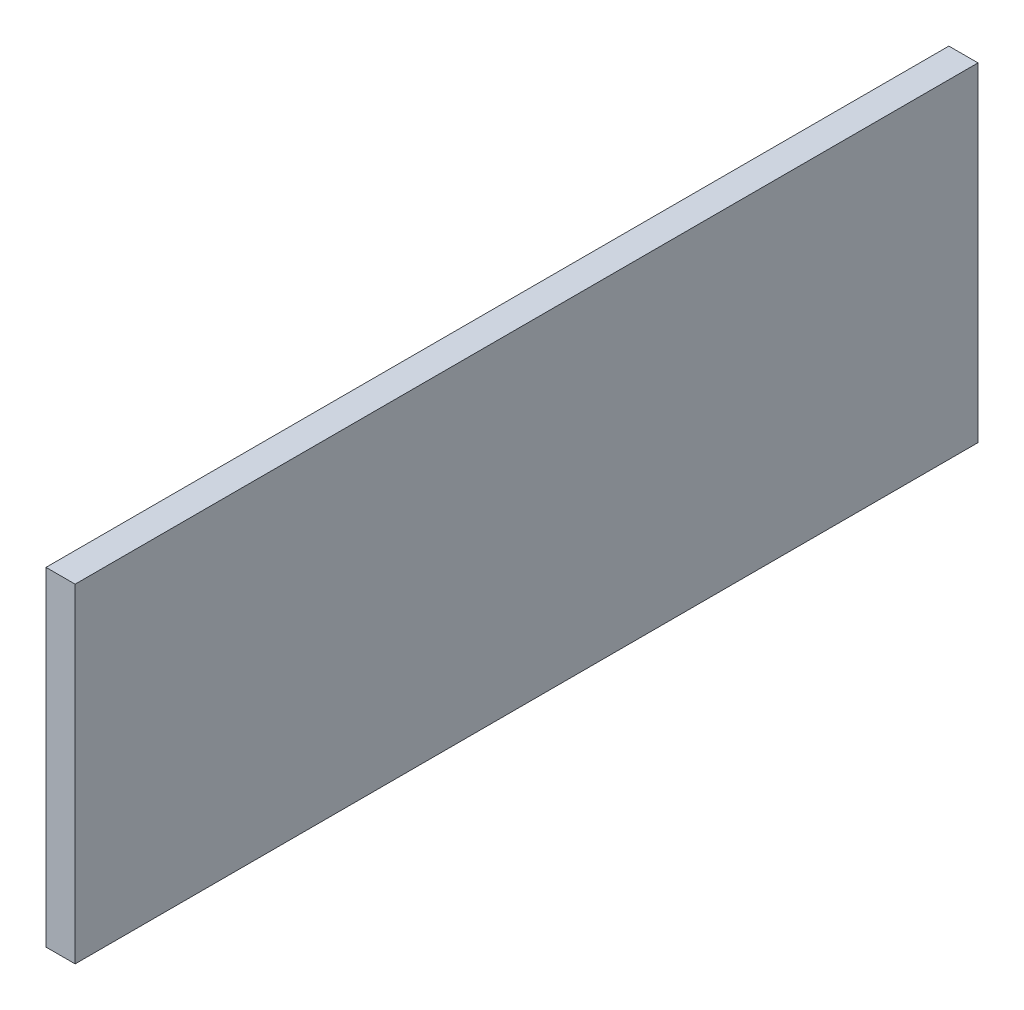
ISO-10303-21;
HEADER;
FILE_DESCRIPTION(('STEP AP214'),'2;1');
FILE_NAME('part.step','',(''),(''),'','','');
FILE_SCHEMA(('AUTOMOTIVE_DESIGN { 1 0 10303 214 1 1 1 1 }'));
ENDSEC;
DATA;
#1=APPLICATION_CONTEXT('core data for automotive mechanical design processes');
#2=APPLICATION_PROTOCOL_DEFINITION('international standard','automotive_design',2000,#1);
#3=PRODUCT_CONTEXT('',#1,'mechanical');
#4=PRODUCT('Part','Part','',(#3));
#5=PRODUCT_RELATED_PRODUCT_CATEGORY('part','',(#4));
#6=PRODUCT_DEFINITION_FORMATION('','',#4);
#7=PRODUCT_DEFINITION_CONTEXT('part definition',#1,'design');
#8=PRODUCT_DEFINITION('design','',#6,#7);
#9=PRODUCT_DEFINITION_SHAPE('','',#8);
#10=(LENGTH_UNIT() NAMED_UNIT(*) SI_UNIT(.MILLI.,.METRE.));
#11=(NAMED_UNIT(*) PLANE_ANGLE_UNIT() SI_UNIT($,.RADIAN.));
#12=(NAMED_UNIT(*) SI_UNIT($,.STERADIAN.) SOLID_ANGLE_UNIT());
#13=UNCERTAINTY_MEASURE_WITH_UNIT(LENGTH_MEASURE(1.E-05),#10,'distance_accuracy_value','');
#14=(GEOMETRIC_REPRESENTATION_CONTEXT(3) GLOBAL_UNCERTAINTY_ASSIGNED_CONTEXT((#13)) GLOBAL_UNIT_ASSIGNED_CONTEXT((#10,
#11,#12)) REPRESENTATION_CONTEXT('',''));
#15=CARTESIAN_POINT('',(0.,0.,0.));
#16=DIRECTION('',(0.,0.,1.));
#17=DIRECTION('',(1.,0.,0.));
#18=AXIS2_PLACEMENT_3D('',#15,#16,#17);
#19=CARTESIAN_POINT('',(3.,-56.7136635749748,-41.0383830188961));
#20=DIRECTION('',(0.,0.,1.));
#21=DIRECTION('',(1.,0.,0.));
#22=AXIS2_PLACEMENT_3D('',#19,#20,#21);
#23=PLANE('',#22);
#24=DIRECTION('',(0.,1.,0.));
#25=VECTOR('',#24,1.);
#26=CARTESIAN_POINT('',(0.,-56.7136635749748,-41.0383830188961));
#27=LINE('',#26,#25);
#28=CARTESIAN_POINT('',(0.,-56.7136635749748,-41.0383830188961));
#29=VERTEX_POINT('',#28);
#30=CARTESIAN_POINT('',(0.,-22.8366987069379,-41.0383830188961));
#31=VERTEX_POINT('',#30);
#32=EDGE_CURVE('E96',#29,#31,#27,.T.);
#33=ORIENTED_EDGE('',*,*,#32,.T.);
#34=DIRECTION('',(-1.,0.,0.));
#35=VECTOR('',#34,1.);
#36=CARTESIAN_POINT('',(3.,-22.8366987069379,-41.0383830188961));
#37=LINE('',#36,#35);
#38=CARTESIAN_POINT('',(3.,-22.8366987069379,-41.0383830188961));
#39=VERTEX_POINT('',#38);
#40=EDGE_CURVE('E11',#39,#31,#37,.T.);
#41=ORIENTED_EDGE('',*,*,#40,.F.);
#42=DIRECTION('',(0.,1.,0.));
#43=VECTOR('',#42,1.);
#44=CARTESIAN_POINT('',(3.,-56.7136635749748,-41.0383830188961));
#45=LINE('',#44,#43);
#46=CARTESIAN_POINT('',(3.,-56.7136635749748,-41.0383830188961));
#47=VERTEX_POINT('',#46);
#48=EDGE_CURVE('E84',#47,#39,#45,.T.);
#49=ORIENTED_EDGE('',*,*,#48,.F.);
#50=DIRECTION('',(-1.,0.,0.));
#51=VECTOR('',#50,1.);
#52=CARTESIAN_POINT('',(3.,-56.7136635749748,-41.0383830188961));
#53=LINE('',#52,#51);
#54=EDGE_CURVE('E92',#47,#29,#53,.T.);
#55=ORIENTED_EDGE('',*,*,#54,.T.);
#56=EDGE_LOOP('',(#33,#41,#49,#55));
#57=FACE_BOUND('',#56,.T.);
#58=ADVANCED_FACE('F33',(#57),#23,.F.);
#59=CARTESIAN_POINT('',(3.,-22.8366987069379,51.9616169811039));
#60=DIRECTION('',(0.,-1.,0.));
#61=DIRECTION('',(0.,0.,-1.));
#62=AXIS2_PLACEMENT_3D('',#59,#60,#61);
#63=PLANE('',#62);
#64=DIRECTION('',(0.,0.,1.));
#65=VECTOR('',#64,1.);
#66=CARTESIAN_POINT('',(0.,-22.8366987069379,51.9616169811039));
#67=LINE('',#66,#65);
#68=CARTESIAN_POINT('',(0.,-22.8366987069379,51.9616169811039));
#69=VERTEX_POINT('',#68);
#70=EDGE_CURVE('E88',#31,#69,#67,.T.);
#71=ORIENTED_EDGE('',*,*,#70,.T.);
#72=DIRECTION('',(-1.,0.,0.));
#73=VECTOR('',#72,1.);
#74=CARTESIAN_POINT('',(3.,-22.8366987069379,51.9616169811039));
#75=LINE('',#74,#73);
#76=CARTESIAN_POINT('',(3.,-22.8366987069379,51.9616169811039));
#77=VERTEX_POINT('',#76);
#78=EDGE_CURVE('E41',#77,#69,#75,.T.);
#79=ORIENTED_EDGE('',*,*,#78,.F.);
#80=DIRECTION('',(0.,0.,1.));
#81=VECTOR('',#80,1.);
#82=CARTESIAN_POINT('',(3.,-22.8366987069379,51.9616169811039));
#83=LINE('',#82,#81);
#84=EDGE_CURVE('E79',#39,#77,#83,.T.);
#85=ORIENTED_EDGE('',*,*,#84,.F.);
#86=ORIENTED_EDGE('',*,*,#40,.T.);
#87=EDGE_LOOP('',(#71,#79,#85,#86));
#88=FACE_BOUND('',#87,.T.);
#89=ADVANCED_FACE('F87',(#88),#63,.F.);
#90=CARTESIAN_POINT('',(3.,-56.7136635749748,51.9616169811039));
#91=DIRECTION('',(0.,0.,-1.));
#92=DIRECTION('',(-1.,0.,0.));
#93=AXIS2_PLACEMENT_3D('',#90,#91,#92);
#94=PLANE('',#93);
#95=DIRECTION('',(0.,-1.,0.));
#96=VECTOR('',#95,1.);
#97=CARTESIAN_POINT('',(0.,-56.7136635749748,51.9616169811039));
#98=LINE('',#97,#96);
#99=CARTESIAN_POINT('',(0.,-56.7136635749748,51.9616169811039));
#100=VERTEX_POINT('',#99);
#101=EDGE_CURVE('E66',#69,#100,#98,.T.);
#102=ORIENTED_EDGE('',*,*,#101,.T.);
#103=DIRECTION('',(-1.,0.,0.));
#104=VECTOR('',#103,1.);
#105=CARTESIAN_POINT('',(3.,-56.7136635749748,51.9616169811039));
#106=LINE('',#105,#104);
#107=CARTESIAN_POINT('',(3.,-56.7136635749748,51.9616169811039));
#108=VERTEX_POINT('',#107);
#109=EDGE_CURVE('E89',#108,#100,#106,.T.);
#110=ORIENTED_EDGE('',*,*,#109,.F.);
#111=DIRECTION('',(0.,-1.,0.));
#112=VECTOR('',#111,1.);
#113=CARTESIAN_POINT('',(3.,-56.7136635749748,51.9616169811039));
#114=LINE('',#113,#112);
#115=EDGE_CURVE('E82',#77,#108,#114,.T.);
#116=ORIENTED_EDGE('',*,*,#115,.F.);
#117=ORIENTED_EDGE('',*,*,#78,.T.);
#118=EDGE_LOOP('',(#102,#110,#116,#117));
#119=FACE_BOUND('',#118,.T.);
#120=ADVANCED_FACE('F90',(#119),#94,.F.);
#121=CARTESIAN_POINT('',(3.,-56.7136635749748,51.9616169811039));
#122=DIRECTION('',(0.,1.,0.));
#123=DIRECTION('',(0.,0.,1.));
#124=AXIS2_PLACEMENT_3D('',#121,#122,#123);
#125=PLANE('',#124);
#126=DIRECTION('',(0.,0.,-1.));
#127=VECTOR('',#126,1.);
#128=CARTESIAN_POINT('',(0.,-56.7136635749748,51.9616169811039));
#129=LINE('',#128,#127);
#130=EDGE_CURVE('E72',#100,#29,#129,.T.);
#131=ORIENTED_EDGE('',*,*,#130,.T.);
#132=ORIENTED_EDGE('',*,*,#54,.F.);
#133=DIRECTION('',(0.,0.,-1.));
#134=VECTOR('',#133,1.);
#135=CARTESIAN_POINT('',(3.,-56.7136635749748,51.9616169811039));
#136=LINE('',#135,#134);
#137=EDGE_CURVE('E49',#108,#47,#136,.T.);
#138=ORIENTED_EDGE('',*,*,#137,.F.);
#139=ORIENTED_EDGE('',*,*,#109,.T.);
#140=EDGE_LOOP('',(#131,#132,#138,#139));
#141=FACE_BOUND('',#140,.T.);
#142=ADVANCED_FACE('F103',(#141),#125,.F.);
#143=CARTESIAN_POINT('',(3.,0.,0.));
#144=DIRECTION('',(-1.,0.,0.));
#145=DIRECTION('',(0.,0.,1.));
#146=AXIS2_PLACEMENT_3D('',#143,#144,#145);
#147=PLANE('',#146);
#148=ORIENTED_EDGE('',*,*,#48,.T.);
#149=ORIENTED_EDGE('',*,*,#84,.T.);
#150=ORIENTED_EDGE('',*,*,#115,.T.);
#151=ORIENTED_EDGE('',*,*,#137,.T.);
#152=EDGE_LOOP('',(#148,#149,#150,#151));
#153=FACE_BOUND('',#152,.T.);
#154=ADVANCED_FACE('F80',(#153),#147,.F.);
#155=CARTESIAN_POINT('',(0.,0.,0.));
#156=DIRECTION('',(-1.,0.,0.));
#157=DIRECTION('',(0.,0.,1.));
#158=AXIS2_PLACEMENT_3D('',#155,#156,#157);
#159=PLANE('',#158);
#160=ORIENTED_EDGE('',*,*,#32,.F.);
#161=ORIENTED_EDGE('',*,*,#130,.F.);
#162=ORIENTED_EDGE('',*,*,#101,.F.);
#163=ORIENTED_EDGE('',*,*,#70,.F.);
#164=EDGE_LOOP('',(#160,#161,#162,#163));
#165=FACE_BOUND('',#164,.T.);
#166=ADVANCED_FACE('F106',(#165),#159,.T.);
#167=CLOSED_SHELL('',(#58,#89,#120,#142,#154,#166));
#168=MANIFOLD_SOLID_BREP('B2',#167);
#169=ADVANCED_BREP_SHAPE_REPRESENTATION('',(#18,#168),#14);
#170=SHAPE_DEFINITION_REPRESENTATION(#9,#169);
ENDSEC;
END-ISO-10303-21;
